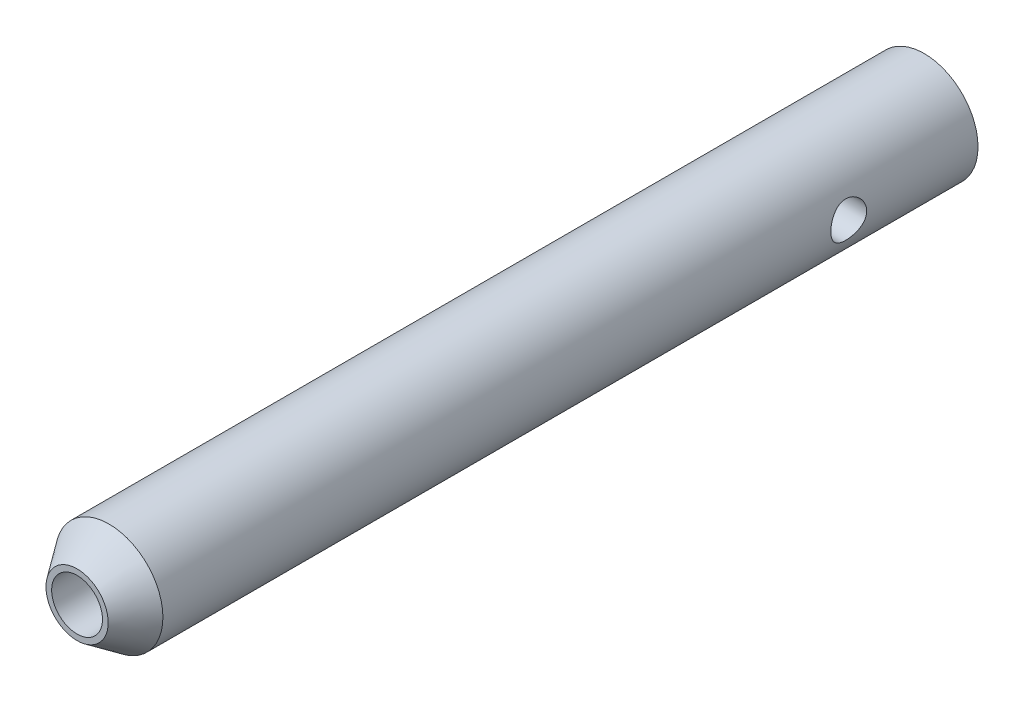
ISO-10303-21;
HEADER;
FILE_DESCRIPTION(('STEP AP214'),'2;1');
FILE_NAME('part.step','',(''),(''),'','','');
FILE_SCHEMA(('AUTOMOTIVE_DESIGN { 1 0 10303 214 1 1 1 1 }'));
ENDSEC;
DATA;
#1=APPLICATION_CONTEXT('core data for automotive mechanical design processes');
#2=APPLICATION_PROTOCOL_DEFINITION('international standard','automotive_design',2000,#1);
#3=PRODUCT_CONTEXT('',#1,'mechanical');
#4=PRODUCT('Part','Part','',(#3));
#5=PRODUCT_RELATED_PRODUCT_CATEGORY('part','',(#4));
#6=PRODUCT_DEFINITION_FORMATION('','',#4);
#7=PRODUCT_DEFINITION_CONTEXT('part definition',#1,'design');
#8=PRODUCT_DEFINITION('design','',#6,#7);
#9=PRODUCT_DEFINITION_SHAPE('','',#8);
#10=(LENGTH_UNIT() NAMED_UNIT(*) SI_UNIT(.MILLI.,.METRE.));
#11=(NAMED_UNIT(*) PLANE_ANGLE_UNIT() SI_UNIT($,.RADIAN.));
#12=(NAMED_UNIT(*) SI_UNIT($,.STERADIAN.) SOLID_ANGLE_UNIT());
#13=UNCERTAINTY_MEASURE_WITH_UNIT(LENGTH_MEASURE(1.E-05),#10,'distance_accuracy_value','');
#14=(GEOMETRIC_REPRESENTATION_CONTEXT(3) GLOBAL_UNCERTAINTY_ASSIGNED_CONTEXT((#13)) GLOBAL_UNIT_ASSIGNED_CONTEXT((#10,
#11,#12)) REPRESENTATION_CONTEXT('',''));
#15=CARTESIAN_POINT('',(0.,0.,0.));
#16=DIRECTION('',(0.,0.,1.));
#17=DIRECTION('',(1.,0.,0.));
#18=AXIS2_PLACEMENT_3D('',#15,#16,#17);
#19=CARTESIAN_POINT('',(1.11022302462516E-13,-6.66133814775094E-13,113.));
#20=DIRECTION('',(0.,0.,-1.));
#21=DIRECTION('',(-1.,0.,0.));
#22=AXIS2_PLACEMENT_3D('',#19,#20,#21);
#23=CYLINDRICAL_SURFACE('',#22,2.5);
#24=CARTESIAN_POINT('',(3.33066907387547E-13,-6.66133814775094E-13,18.));
#25=DIRECTION('',(0.707106781186547,0.,-0.707106781186547));
#26=DIRECTION('',(-0.707106781186548,0.,-0.707106781186547));
#27=AXIS2_PLACEMENT_3D('',#24,#25,#26);
#28=ELLIPSE('',#27,3.53553390593274,2.5);
#29=CARTESIAN_POINT('',(3.33066907387547E-13,2.49999999999917,18.0000000000001));
#30=VERTEX_POINT('',#29);
#31=CARTESIAN_POINT('',(-1.11022302462516E-13,-2.50000000000083,18.));
#32=VERTEX_POINT('',#31);
#33=EDGE_CURVE('E93',#30,#32,#28,.T.);
#34=ORIENTED_EDGE('',*,*,#33,.T.);
#35=CARTESIAN_POINT('',(3.33066907387547E-13,-6.66133814775094E-13,18.));
#36=DIRECTION('',(-0.707106781186548,0.,-0.707106781186547));
#37=DIRECTION('',(0.707106781186547,0.,-0.707106781186547));
#38=AXIS2_PLACEMENT_3D('',#35,#36,#37);
#39=ELLIPSE('',#38,3.53553390593273,2.49999999999999);
#40=EDGE_CURVE('E81',#32,#30,#39,.T.);
#41=ORIENTED_EDGE('',*,*,#40,.T.);
#42=EDGE_LOOP('',(#34,#41));
#43=FACE_BOUND('',#42,.T.);
#44=CARTESIAN_POINT('',(1.11022302462516E-13,-5.55111512312578E-13,56.2685602834363));
#45=DIRECTION('',(0.,0.,1.));
#46=DIRECTION('',(1.,0.,0.));
#47=AXIS2_PLACEMENT_3D('',#44,#45,#46);
#48=CIRCLE('',#47,2.5);
#49=CARTESIAN_POINT('',(2.50000000000011,-5.55143910283468E-13,56.2685602834363));
#50=VERTEX_POINT('',#49);
#51=EDGE_CURVE('E70',#50,#50,#48,.F.);
#52=ORIENTED_EDGE('',*,*,#51,.F.);
#53=EDGE_LOOP('',(#52));
#54=FACE_BOUND('',#53,.T.);
#55=ADVANCED_FACE('F66',(#43,#54),#23,.F.);
#56=CARTESIAN_POINT('',(3.33066907387547E-13,-6.66133814775094E-13,18.));
#57=DIRECTION('',(-0.707106781186548,0.,-0.707106781186547));
#58=DIRECTION('',(0.707106781186547,0.,-0.707106781186547));
#59=AXIS2_PLACEMENT_3D('',#56,#57,#58);
#60=ELLIPSE('',#59,3.53553390593274,2.5);
#61=EDGE_CURVE('E75',#32,#30,#60,.F.);
#62=ORIENTED_EDGE('',*,*,#61,.T.);
#63=CARTESIAN_POINT('',(3.33066907387547E-13,-6.66133814775094E-13,18.));
#64=DIRECTION('',(0.707106781186547,0.,-0.707106781186547));
#65=DIRECTION('',(-0.707106781186548,0.,-0.707106781186547));
#66=AXIS2_PLACEMENT_3D('',#63,#64,#65);
#67=ELLIPSE('',#66,3.53553390593273,2.49999999999999);
#68=EDGE_CURVE('E83',#30,#32,#67,.F.);
#69=ORIENTED_EDGE('',*,*,#68,.T.);
#70=EDGE_LOOP('',(#62,#69));
#71=FACE_BOUND('',#70,.T.);
#72=CARTESIAN_POINT('',(-1.11022302462516E-13,-7.7715611723761E-13,5.00000000000003));
#73=DIRECTION('',(0.,0.,-1.));
#74=DIRECTION('',(-1.,0.,0.));
#75=AXIS2_PLACEMENT_3D('',#72,#73,#74);
#76=CIRCLE('',#75,2.5);
#77=CARTESIAN_POINT('',(-2.50000000000011,-7.7712371926672E-13,5.00000000000003));
#78=VERTEX_POINT('',#77);
#79=EDGE_CURVE('E132',#78,#78,#76,.T.);
#80=ORIENTED_EDGE('',*,*,#79,.T.);
#81=EDGE_LOOP('',(#80));
#82=FACE_BOUND('',#81,.T.);
#83=ADVANCED_FACE('F100',(#71,#82),#23,.F.);
#84=CARTESIAN_POINT('',(-1.11022302462516E-13,-7.7715611723761E-13,5.00000000000003));
#85=DIRECTION('',(0.,0.,-1.));
#86=DIRECTION('',(-1.,0.,0.));
#87=AXIS2_PLACEMENT_3D('',#84,#85,#86);
#88=PLANE('',#87);
#89=ORIENTED_EDGE('',*,*,#79,.F.);
#90=EDGE_LOOP('',(#89));
#91=FACE_BOUND('',#90,.T.);
#92=ADVANCED_FACE('F124',(#91),#88,.F.);
#93=CARTESIAN_POINT('',(7.49999999999995,-4.44089209850063E-13,18.0000000000001));
#94=DIRECTION('',(-1.,0.,0.));
#95=DIRECTION('',(0.,0.,1.));
#96=AXIS2_PLACEMENT_3D('',#93,#94,#95);
#97=CYLINDRICAL_SURFACE('',#96,2.5);
#98=CARTESIAN_POINT('',(7.50000000000017,-5.55111512312578E-13,20.5));
#99=CARTESIAN_POINT('',(7.50000038252377,-0.136408407217421,20.5000006343291));
#100=CARTESIAN_POINT('',(7.49624423768891,-0.272812986347038,20.488799334682));
#101=CARTESIAN_POINT('',(7.48163025508237,-0.541604402183219,20.444427227957));
#102=CARTESIAN_POINT('',(7.4707716800541,-0.673990820297909,20.4112541401278));
#103=CARTESIAN_POINT('',(7.44313269766133,-0.930831973755313,20.3242018915399));
#104=CARTESIAN_POINT('',(7.42636219327163,-1.05529956471589,20.2703573438516));
#105=CARTESIAN_POINT('',(7.38861114293379,-1.29343734201418,20.143647067904));
#106=CARTESIAN_POINT('',(7.36762976669461,-1.40710539239775,20.0707775874936));
#107=CARTESIAN_POINT('',(7.32285236107528,-1.62435418755657,19.9054354878532));
#108=CARTESIAN_POINT('',(7.29898891159487,-1.72750925074646,19.8124219143486));
#109=CARTESIAN_POINT('',(7.25150786957835,-1.91708173175582,19.6105821132334));
#110=CARTESIAN_POINT('',(7.22789033226403,-2.00349546372439,19.5017524126787));
#111=CARTESIAN_POINT('',(7.1828333119322,-2.15956235557034,19.2675372120089));
#112=CARTESIAN_POINT('',(7.16147598189264,-2.22866214555308,19.1417656506696));
#113=CARTESIAN_POINT('',(7.12438263546523,-2.3445471846948,18.8795597638536));
#114=CARTESIAN_POINT('',(7.10864490401852,-2.3913392434676,18.7431287070932));
#115=CARTESIAN_POINT('',(7.08528258173438,-2.45968365377351,18.4683169462583));
#116=CARTESIAN_POINT('',(7.07740239424058,-2.48203362067978,18.3301569787774));
#117=CARTESIAN_POINT('',(7.06989141573805,-2.50335280833673,18.0518406146103));
#118=CARTESIAN_POINT('',(7.07025807556833,-2.50232925401278,17.911684848227));
#119=CARTESIAN_POINT('',(7.07897537520457,-2.4775497592595,17.64015842389));
#120=CARTESIAN_POINT('',(7.08696039668862,-2.45483478291802,17.5086789927026));
#121=CARTESIAN_POINT('',(7.10941644311412,-2.38901540712395,17.2515164509831));
#122=CARTESIAN_POINT('',(7.12388824460285,-2.34590856648039,17.1258340364123));
#123=CARTESIAN_POINT('',(7.15794777828136,-2.23984764515131,16.8814681260214));
#124=CARTESIAN_POINT('',(7.17761414482825,-2.1765851217687,16.7629299363264));
#125=CARTESIAN_POINT('',(7.21981396439346,-2.03222276575836,16.5378227293009));
#126=CARTESIAN_POINT('',(7.2423482447617,-1.95111778091074,16.4312571826665));
#127=CARTESIAN_POINT('',(7.28918322919361,-1.76837333170641,16.2272710045981));
#128=CARTESIAN_POINT('',(7.31351473387135,-1.66588287519146,16.1306182637275));
#129=CARTESIAN_POINT('',(7.36017345967621,-1.44584892492582,15.9556718333418));
#130=CARTESIAN_POINT('',(7.38250048845181,-1.32830398915282,15.8773799045888));
#131=CARTESIAN_POINT('',(7.42292769844493,-1.07986903261653,15.7407592494124));
#132=CARTESIAN_POINT('',(7.44098375020121,-0.948858191041662,15.6826362716484));
#133=CARTESIAN_POINT('',(7.47051417861123,-0.678172708412102,15.5894920651109));
#134=CARTESIAN_POINT('',(7.48199084137232,-0.538501095388271,15.5544628114415));
#135=CARTESIAN_POINT('',(7.49669067678635,-0.260959573824147,15.5098608349441));
#136=CARTESIAN_POINT('',(7.50025004584355,-0.123273999662949,15.4992504770682));
#137=CARTESIAN_POINT('',(7.49972256737101,0.151937674899842,15.5008316839962));
#138=CARTESIAN_POINT('',(7.49563701048435,0.289463798298402,15.5130193999497));
#139=CARTESIAN_POINT('',(7.48050061792799,0.556299665759965,15.5590297693399));
#140=CARTESIAN_POINT('',(7.46965496778029,0.685732017086456,15.5922155151237));
#141=CARTESIAN_POINT('',(7.44229617075198,0.937139896448189,15.6784836111668));
#142=CARTESIAN_POINT('',(7.42578230116675,1.05911447127066,15.7315684986695));
#143=CARTESIAN_POINT('',(7.38822328218214,1.29572074098236,15.857676079602));
#144=CARTESIAN_POINT('',(7.36707036889494,1.41007489804221,15.9311864832078));
#145=CARTESIAN_POINT('',(7.32263134790705,1.62516207533819,16.0954853750336));
#146=CARTESIAN_POINT('',(7.29934458984597,1.72589091948789,16.1862791400795));
#147=CARTESIAN_POINT('',(7.25192119951132,1.91563126951476,16.3874468775165));
#148=CARTESIAN_POINT('',(7.22779402718604,2.00390242311379,16.498523067317));
#149=CARTESIAN_POINT('',(7.18249933236814,2.16064380580834,16.734428919527));
#150=CARTESIAN_POINT('',(7.16133183455042,2.22911386982662,16.8592586965852));
#151=CARTESIAN_POINT('',(7.12455979478493,2.34399232604001,17.1191825382248));
#152=CARTESIAN_POINT('',(7.10894401982485,2.39044533041198,17.2542551979219));
#153=CARTESIAN_POINT('',(7.08527080766154,2.45973666689802,17.5309466251103));
#154=CARTESIAN_POINT('',(7.07720996559116,2.48258563738436,17.6725624135109));
#155=CARTESIAN_POINT('',(7.06994647185462,2.50319070619284,17.9504927401023));
#156=CARTESIAN_POINT('',(7.07031000643569,2.50217564327056,18.0867058507171));
#157=CARTESIAN_POINT('',(7.07878174559703,2.47810573362128,18.3569126873052));
#158=CARTESIAN_POINT('',(7.08688948923431,2.45505219864592,18.4909065448877));
#159=CARTESIAN_POINT('',(7.10961310762255,2.38842953282281,18.7503391575062));
#160=CARTESIAN_POINT('',(7.12410245056227,2.34525836503832,18.8758920625113));
#161=CARTESIAN_POINT('',(7.15790997046206,2.23994841439892,19.1180685173457));
#162=CARTESIAN_POINT('',(7.17722921908513,2.17780542138399,19.23469007797));
#163=CARTESIAN_POINT('',(7.21957073065146,2.03315173145805,19.4612091748073));
#164=CARTESIAN_POINT('',(7.2427177910538,1.949870606911,19.5705912547461));
#165=CARTESIAN_POINT('',(7.28958390708164,1.76660720783857,19.7742245334606));
#166=CARTESIAN_POINT('',(7.31330312280951,1.66662021112798,19.8684714392202));
#167=CARTESIAN_POINT('',(7.3597507631388,1.44810389230096,20.0428610307229));
#168=CARTESIAN_POINT('',(7.38240454503173,1.32900378374871,20.1223108693776));
#169=CARTESIAN_POINT('',(7.42314977931568,1.07839339351609,20.2599760721267));
#170=CARTESIAN_POINT('',(7.44124239769857,0.946886295330394,20.3181968648051));
#171=CARTESIAN_POINT('',(7.47013787671387,0.681234118001967,20.4093040812217));
#172=CARTESIAN_POINT('',(7.48123031056344,0.547469394190554,20.4432061656585));
#173=CARTESIAN_POINT('',(7.49616017660584,0.275801040025121,20.4885507016929));
#174=CARTESIAN_POINT('',(7.4999996132978,0.137898563921336,20.4999993587414));
#175=CARTESIAN_POINT('',(7.50000000000017,-5.55111512312578E-13,20.5));
#176=B_SPLINE_CURVE_WITH_KNOTS('',3,(#98,#99,#100,#101,#102,#103,#104,#105,#106,#107,#108,#109,
#110,#111,#112,#113,#114,#115,#116,#117,#118,#119,#120,#121,#122,#123,#124,#125,#126,#127,#128,
#129,#130,#131,#132,#133,#134,#135,#136,#137,#138,#139,#140,#141,#142,#143,#144,#145,#146,#147,
#148,#149,#150,#151,#152,#153,#154,#155,#156,#157,#158,#159,#160,#161,#162,#163,#164,#165,#166,
#167,#168,#169,#170,#171,#172,#173,#174,#175),.UNSPECIFIED.,.T.,.F.,(4,2,2,2,2,2,2,2,2,2,2,2,2,
2,2,2,2,2,2,2,2,2,2,2,2,2,2,2,2,2,2,2,2,2,2,2,2,2,4),(0.,0.408717765065198,0.817477963169134,
1.22555668217603,1.63371594449811,2.05461710706915,2.4756108321884,2.90870962058688,
3.34167611732093,3.7600481435461,4.17829084968719,4.57742066378204,4.97659827138709,
5.3822042788783,5.78792756395518,6.21483264528411,6.64177864916534,7.07296014125879,
7.50399172193002,7.91633957937917,8.32861782910446,8.72895394945534,9.12934113210256,
9.5402599960933,9.95130452054708,10.3810255720187,10.8107502058748,11.2396003456693,
11.668257117646,12.0748916516065,12.4815019837845,12.8803896770105,13.2793659543995,
13.6957516672953,14.1122552780947,14.5449915208777,14.9776170288114,15.3909139593454,
15.8040966509536),.UNSPECIFIED.);
#177=CARTESIAN_POINT('',(7.50000000000017,-5.55111512312578E-13,20.5));
#178=VERTEX_POINT('',#177);
#179=EDGE_CURVE('E94',#178,#178,#176,.T.);
#180=ORIENTED_EDGE('',*,*,#179,.T.);
#181=EDGE_LOOP('',(#180));
#182=FACE_BOUND('',#181,.T.);
#183=ORIENTED_EDGE('',*,*,#33,.F.);
#184=ORIENTED_EDGE('',*,*,#61,.F.);
#185=EDGE_LOOP('',(#183,#184));
#186=FACE_BOUND('',#185,.T.);
#187=ADVANCED_FACE('F97',(#182,#186),#97,.F.);
#188=CARTESIAN_POINT('',(3.33066907387547E-13,-4.44089209850063E-13,118.));
#189=DIRECTION('',(0.,0.,-1.));
#190=DIRECTION('',(-1.,0.,0.));
#191=AXIS2_PLACEMENT_3D('',#188,#189,#190);
#192=CYLINDRICAL_SURFACE('',#191,7.5);
#193=CARTESIAN_POINT('',(-7.49999999999973,-8.88178419700125E-13,20.5));
#194=CARTESIAN_POINT('',(-7.50000038252336,0.13640840721593,20.5000006343291));
#195=CARTESIAN_POINT('',(-7.49624423768831,0.272812986345522,20.488799334682));
#196=CARTESIAN_POINT('',(-7.4816302550817,0.541604402181618,20.444427227957));
#197=CARTESIAN_POINT('',(-7.47077168005355,0.673990820296247,20.4112541401277));
#198=CARTESIAN_POINT('',(-7.44313269766076,0.930831973753751,20.3242018915398));
#199=CARTESIAN_POINT('',(-7.42636219327092,1.05529956471449,20.2703573438518));
#200=CARTESIAN_POINT('',(-7.3886111429333,1.29343734201296,20.1436470679042));
#201=CARTESIAN_POINT('',(-7.3676297666945,1.40710539239656,20.0707775874935));
#202=CARTESIAN_POINT('',(-7.32285236107519,1.62435418755547,19.9054354878531));
#203=CARTESIAN_POINT('',(-7.29898891159439,1.72750925074543,19.8124219143488));
#204=CARTESIAN_POINT('',(-7.2515078695776,1.91708173175465,19.6105821132336));
#205=CARTESIAN_POINT('',(-7.22789033226337,2.00349546372302,19.5017524126787));
#206=CARTESIAN_POINT('',(-7.18283331193152,2.15956235556906,19.2675372120089));
#207=CARTESIAN_POINT('',(-7.16147598189182,2.22866214555212,19.1417656506698));
#208=CARTESIAN_POINT('',(-7.12438263546477,2.34454718469377,18.8795597638537));
#209=CARTESIAN_POINT('',(-7.10864490401857,2.39133924346619,18.7431287070932));
#210=CARTESIAN_POINT('',(-7.08528258173433,2.45968365377226,18.4683169462582));
#211=CARTESIAN_POINT('',(-7.07740239424,2.48203362067903,18.3301569787774));
#212=CARTESIAN_POINT('',(-7.06989141573732,2.50335280833566,18.0518406146104));
#213=CARTESIAN_POINT('',(-7.07025807556798,2.50232925401087,17.9116848482271));
#214=CARTESIAN_POINT('',(-7.07897537520425,2.47754975925764,17.6401584238899));
#215=CARTESIAN_POINT('',(-7.08696039668799,2.45483478291697,17.5086789927023));
#216=CARTESIAN_POINT('',(-7.10941644311347,2.38901540712308,17.2515164509828));
#217=CARTESIAN_POINT('',(-7.12388824460249,2.3459085664789,17.1258340364123));
#218=CARTESIAN_POINT('',(-7.15794777828105,2.23984764514969,16.8814681260213));
#219=CARTESIAN_POINT('',(-7.17761414482769,2.17658512176759,16.762929936326));
#220=CARTESIAN_POINT('',(-7.21981396439282,2.03222276575723,16.5378227293005));
#221=CARTESIAN_POINT('',(-7.24234824476124,1.95111778090908,16.4312571826666));
#222=CARTESIAN_POINT('',(-7.28918322919318,1.76837333170455,16.2272710045981));
#223=CARTESIAN_POINT('',(-7.31351473387075,1.66588287519,16.1306182637272));
#224=CARTESIAN_POINT('',(-7.36017345967567,1.44584892492458,15.9556718333413));
#225=CARTESIAN_POINT('',(-7.38250048845149,1.32830398915141,15.8773799045887));
#226=CARTESIAN_POINT('',(-7.4229276984446,1.07986903261499,15.7407592494124));
#227=CARTESIAN_POINT('',(-7.44098375020064,0.948858191040161,15.6826362716481));
#228=CARTESIAN_POINT('',(-7.47051417861061,0.678172708410524,15.5894920651107));
#229=CARTESIAN_POINT('',(-7.48199084137189,0.538501095386575,15.5544628114414));
#230=CARTESIAN_POINT('',(-7.49669067678589,0.260959573822364,15.5098608349442));
#231=CARTESIAN_POINT('',(-7.50025004584288,0.123273999661196,15.4992504770682));
#232=CARTESIAN_POINT('',(-7.49972256737033,-0.151937674901562,15.5008316839962));
#233=CARTESIAN_POINT('',(-7.49563701048387,-0.289463798300121,15.5130193999497));
#234=CARTESIAN_POINT('',(-7.48050061792737,-0.556299665761505,15.5590297693399));
#235=CARTESIAN_POINT('',(-7.46965496777937,-0.685732017087826,15.5922155151238));
#236=CARTESIAN_POINT('',(-7.44229617075148,-0.93713989644946,15.6784836111669));
#237=CARTESIAN_POINT('',(-7.42578230116698,-1.059114471272,15.7315684986695));
#238=CARTESIAN_POINT('',(-7.38822328218233,-1.29572074098362,15.857676079602));
#239=CARTESIAN_POINT('',(-7.36707036889432,-1.41007489804328,15.931186483208));
#240=CARTESIAN_POINT('',(-7.3226313479062,-1.62516207533957,16.0954853750338));
#241=CARTESIAN_POINT('',(-7.2993445898457,-1.72589091948976,16.1862791400794));
#242=CARTESIAN_POINT('',(-7.25192119951118,-1.91563126951655,16.3874468775164));
#243=CARTESIAN_POINT('',(-7.22779402718542,-2.003902423115,16.4985230673171));
#244=CARTESIAN_POINT('',(-7.18249933236734,-2.16064380580921,16.7344289195273));
#245=CARTESIAN_POINT('',(-7.16133183454993,-2.22911386982774,16.8592586965852));
#246=CARTESIAN_POINT('',(-7.12455979478452,-2.34399232604115,17.1191825382248));
#247=CARTESIAN_POINT('',(-7.10894401982421,-2.39044533041289,17.2542551979219));
#248=CARTESIAN_POINT('',(-7.08527080766084,-2.45973666689892,17.5309466251103));
#249=CARTESIAN_POINT('',(-7.07720996559063,-2.48258563738548,17.6725624135109));
#250=CARTESIAN_POINT('',(-7.06994647185405,-2.50319070619394,17.9504927401023));
#251=CARTESIAN_POINT('',(-7.07031000643494,-2.50217564327146,18.0867058507171));
#252=CARTESIAN_POINT('',(-7.07878174559646,-2.47810573362214,18.3569126873051));
#253=CARTESIAN_POINT('',(-7.0868894892341,-2.45505219864693,18.4909065448877));
#254=CARTESIAN_POINT('',(-7.10961310762232,-2.3884295328238,18.7503391575062));
#255=CARTESIAN_POINT('',(-7.12410245056168,-2.34525836503914,18.8758920625112));
#256=CARTESIAN_POINT('',(-7.15790997046131,-2.2399484143999,19.1180685173457));
#257=CARTESIAN_POINT('',(-7.17722921908457,-2.1778054213853,19.2346900779701));
#258=CARTESIAN_POINT('',(-7.2195707306509,-2.03315173145941,19.4612091748073));
#259=CARTESIAN_POINT('',(-7.24271779105301,-1.94987060691206,19.5705912547458));
#260=CARTESIAN_POINT('',(-7.28958390708098,-1.76660720783973,19.7742245334603));
#261=CARTESIAN_POINT('',(-7.3133031228092,-1.66662021112956,19.8684714392202));
#262=CARTESIAN_POINT('',(-7.35975076313847,-1.44810389230266,20.042861030723));
#263=CARTESIAN_POINT('',(-7.38240454503101,-1.32900378375009,20.1223108693773));
#264=CARTESIAN_POINT('',(-7.42314977931495,-1.07839339351729,20.2599760721264));
#265=CARTESIAN_POINT('',(-7.44124239769822,-0.946886295331723,20.3181968648051));
#266=CARTESIAN_POINT('',(-7.47013787671354,-0.681234118003359,20.4093040812217));
#267=CARTESIAN_POINT('',(-7.48123031056278,-0.54746939419189,20.4432061656584));
#268=CARTESIAN_POINT('',(-7.49616017660512,-0.275801040026464,20.4885507016927));
#269=CARTESIAN_POINT('',(-7.49999961329732,-0.137898563922741,20.4999993587413));
#270=CARTESIAN_POINT('',(-7.49999999999973,-8.88178419700125E-13,20.5));
#271=B_SPLINE_CURVE_WITH_KNOTS('',3,(#193,#194,#195,#196,#197,#198,#199,#200,#201,#202,#203,
#204,#205,#206,#207,#208,#209,#210,#211,#212,#213,#214,#215,#216,#217,#218,#219,#220,#221,#222,
#223,#224,#225,#226,#227,#228,#229,#230,#231,#232,#233,#234,#235,#236,#237,#238,#239,#240,#241,
#242,#243,#244,#245,#246,#247,#248,#249,#250,#251,#252,#253,#254,#255,#256,#257,#258,#259,#260,
#261,#262,#263,#264,#265,#266,#267,#268,#269,#270),.UNSPECIFIED.,.T.,.F.,(4,2,2,2,2,2,2,2,2,2,2,
2,2,2,2,2,2,2,2,2,2,2,2,2,2,2,2,2,2,2,2,2,2,2,2,2,2,2,4),(0.,0.408717765065073,
0.817477963168927,1.22555668217608,1.63371594449837,2.05461710706935,2.47561083218858,
2.9087096205871,3.34167611732115,3.76004814354634,4.17829084968752,4.57742066378243,
4.97659827138748,5.38220427887874,5.78792756395573,6.21483264528463,6.64177864916577,
7.07296014125935,7.50399172193076,7.91633957937988,8.32861782910509,8.72895394945567,
9.12934113210264,9.54025999609367,9.95130452054768,10.381025572019,10.810750205875,
11.2396003456694,11.6682571176462,12.0748916516066,12.4815019837846,12.8803896770106,
13.2793659543995,13.6957516672951,14.1122552780944,14.5449915208774,14.9776170288113,
15.3909139593452,15.8040966509533),.UNSPECIFIED.);
#272=CARTESIAN_POINT('',(-7.49999999999973,-8.88178419700125E-13,20.5));
#273=VERTEX_POINT('',#272);
#274=EDGE_CURVE('E13',#273,#273,#271,.T.);
#275=ORIENTED_EDGE('',*,*,#274,.F.);
#276=EDGE_LOOP('',(#275));
#277=FACE_BOUND('',#276,.T.);
#278=ORIENTED_EDGE('',*,*,#179,.F.);
#279=EDGE_LOOP('',(#278));
#280=FACE_BOUND('',#279,.T.);
#281=CARTESIAN_POINT('',(0.,-4.44089209850063E-13,113.540736));
#282=DIRECTION('',(0.,0.,1.));
#283=DIRECTION('',(1.,0.,0.));
#284=AXIS2_PLACEMENT_3D('',#281,#282,#283);
#285=CIRCLE('',#284,7.5);
#286=CARTESIAN_POINT('',(7.5,-4.44186403762733E-13,113.540736));
#287=VERTEX_POINT('',#286);
#288=EDGE_CURVE('E135',#287,#287,#285,.T.);
#289=ORIENTED_EDGE('',*,*,#288,.F.);
#290=EDGE_LOOP('',(#289));
#291=FACE_BOUND('',#290,.T.);
#292=CARTESIAN_POINT('',(0.,0.,0.));
#293=DIRECTION('',(0.,0.,-1.));
#294=DIRECTION('',(1.,0.,0.));
#295=AXIS2_PLACEMENT_3D('',#292,#293,#294);
#296=CIRCLE('',#295,7.5);
#297=CARTESIAN_POINT('',(7.5,0.,0.));
#298=VERTEX_POINT('',#297);
#299=EDGE_CURVE('E140',#298,#298,#296,.T.);
#300=ORIENTED_EDGE('',*,*,#299,.F.);
#301=EDGE_LOOP('',(#300));
#302=FACE_BOUND('',#301,.T.);
#303=ADVANCED_FACE('F109',(#277,#280,#291,#302),#192,.T.);
#304=CARTESIAN_POINT('',(0.,0.,0.));
#305=DIRECTION('',(0.,0.,-1.));
#306=DIRECTION('',(-1.,0.,0.));
#307=AXIS2_PLACEMENT_3D('',#304,#305,#306);
#308=PLANE('',#307);
#309=ORIENTED_EDGE('',*,*,#299,.T.);
#310=EDGE_LOOP('',(#309));
#311=FACE_BOUND('',#310,.T.);
#312=ADVANCED_FACE('F270',(#311),#308,.T.);
#313=CARTESIAN_POINT('',(3.33066907387547E-13,-4.44089209850063E-13,118.));
#314=DIRECTION('',(0.,0.,-1.));
#315=DIRECTION('',(-1.,0.,0.));
#316=AXIS2_PLACEMENT_3D('',#313,#314,#315);
#317=CONICAL_SURFACE('',#316,4.33433608180037,0.617344235442226);
#318=ORIENTED_EDGE('',*,*,#288,.T.);
#319=EDGE_LOOP('',(#318));
#320=FACE_BOUND('',#319,.T.);
#321=CARTESIAN_POINT('',(3.33066907387547E-13,-4.44089209850063E-13,118.));
#322=DIRECTION('',(0.,0.,1.));
#323=DIRECTION('',(1.,0.,0.));
#324=AXIS2_PLACEMENT_3D('',#321,#322,#323);
#325=CIRCLE('',#324,4.33433608180037);
#326=CARTESIAN_POINT('',(4.3343360818007,-4.44145379327745E-13,118.));
#327=VERTEX_POINT('',#326);
#328=EDGE_CURVE('E98',#327,#327,#325,.T.);
#329=ORIENTED_EDGE('',*,*,#328,.F.);
#330=EDGE_LOOP('',(#329));
#331=FACE_BOUND('',#330,.T.);
#332=ADVANCED_FACE('F277',(#320,#331),#317,.T.);
#333=CARTESIAN_POINT('',(3.33066907387547E-13,-4.44089209850063E-13,118.));
#334=DIRECTION('',(0.,0.,-1.));
#335=DIRECTION('',(-1.,0.,0.));
#336=AXIS2_PLACEMENT_3D('',#333,#334,#335);
#337=PLANE('',#336);
#338=CARTESIAN_POINT('',(3.33066907387547E-13,-4.44089209850063E-13,118.));
#339=DIRECTION('',(0.,0.,1.));
#340=DIRECTION('',(1.,0.,0.));
#341=AXIS2_PLACEMENT_3D('',#338,#339,#340);
#342=CIRCLE('',#341,3.54);
#343=CARTESIAN_POINT('',(3.54000000000033,-4.44135085376843E-13,118.));
#344=VERTEX_POINT('',#343);
#345=EDGE_CURVE('E322',#344,#344,#342,.T.);
#346=ORIENTED_EDGE('',*,*,#345,.F.);
#347=EDGE_LOOP('',(#346));
#348=FACE_BOUND('',#347,.T.);
#349=ORIENTED_EDGE('',*,*,#328,.T.);
#350=EDGE_LOOP('',(#349));
#351=FACE_BOUND('',#350,.T.);
#352=ADVANCED_FACE('F68',(#348,#351),#337,.F.);
#353=CARTESIAN_POINT('',(-7.49999999999995,-4.44089209850063E-13,18.));
#354=DIRECTION('',(-1.,0.,0.));
#355=DIRECTION('',(0.,0.,1.));
#356=AXIS2_PLACEMENT_3D('',#353,#354,#355);
#357=CYLINDRICAL_SURFACE('',#356,2.49999999999999);
#358=ORIENTED_EDGE('',*,*,#274,.T.);
#359=EDGE_LOOP('',(#358));
#360=FACE_BOUND('',#359,.T.);
#361=ORIENTED_EDGE('',*,*,#68,.F.);
#362=ORIENTED_EDGE('',*,*,#40,.F.);
#363=EDGE_LOOP('',(#361,#362));
#364=FACE_BOUND('',#363,.T.);
#365=ADVANCED_FACE('F84',(#360,#364),#357,.F.);
#366=CARTESIAN_POINT('',(1.11022302462516E-13,-5.55111512312578E-13,56.2685602834363));
#367=DIRECTION('',(0.,0.,1.));
#368=DIRECTION('',(1.,0.,0.));
#369=AXIS2_PLACEMENT_3D('',#366,#367,#368);
#370=PLANE('',#369);
#371=CARTESIAN_POINT('',(1.11022302462516E-13,-5.55111512312578E-13,56.2685602834363));
#372=DIRECTION('',(0.,0.,1.));
#373=DIRECTION('',(1.,0.,0.));
#374=AXIS2_PLACEMENT_3D('',#371,#372,#373);
#375=CIRCLE('',#374,3.54);
#376=CARTESIAN_POINT('',(3.54000000000011,-5.55157387839359E-13,56.2685602834363));
#377=VERTEX_POINT('',#376);
#378=EDGE_CURVE('E319',#377,#377,#375,.T.);
#379=ORIENTED_EDGE('',*,*,#378,.T.);
#380=EDGE_LOOP('',(#379));
#381=FACE_BOUND('',#380,.T.);
#382=ORIENTED_EDGE('',*,*,#51,.T.);
#383=EDGE_LOOP('',(#382));
#384=FACE_BOUND('',#383,.T.);
#385=ADVANCED_FACE('F117',(#381,#384),#370,.T.);
#386=CARTESIAN_POINT('',(1.11022302462516E-13,-5.55111512312578E-13,56.2685602834363));
#387=DIRECTION('',(0.,0.,1.));
#388=DIRECTION('',(1.,0.,0.));
#389=AXIS2_PLACEMENT_3D('',#386,#387,#388);
#390=CYLINDRICAL_SURFACE('',#389,3.54);
#391=ORIENTED_EDGE('',*,*,#378,.F.);
#392=EDGE_LOOP('',(#391));
#393=FACE_BOUND('',#392,.T.);
#394=ORIENTED_EDGE('',*,*,#345,.T.);
#395=EDGE_LOOP('',(#394));
#396=FACE_BOUND('',#395,.T.);
#397=ADVANCED_FACE('F119',(#393,#396),#390,.F.);
#398=CLOSED_SHELL('',(#55,#83,#92,#187,#303,#312,#332,#352,#365,#385,#397));
#399=MANIFOLD_SOLID_BREP('B2',#398);
#400=ADVANCED_BREP_SHAPE_REPRESENTATION('',(#18,#399),#14);
#401=SHAPE_DEFINITION_REPRESENTATION(#9,#400);
ENDSEC;
END-ISO-10303-21;
